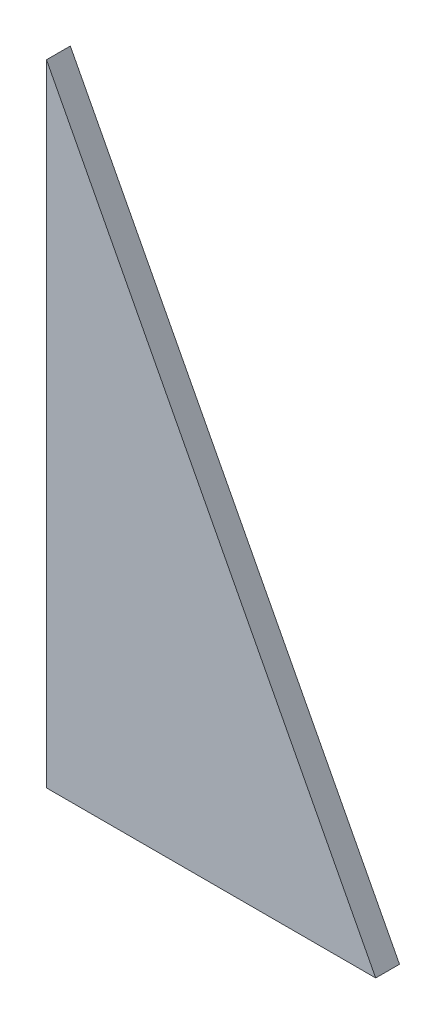
ISO-10303-21;
HEADER;
FILE_DESCRIPTION(('STEP AP214'),'2;1');
FILE_NAME('part.step','',(''),(''),'','','');
FILE_SCHEMA(('AUTOMOTIVE_DESIGN { 1 0 10303 214 1 1 1 1 }'));
ENDSEC;
DATA;
#1=APPLICATION_CONTEXT('core data for automotive mechanical design processes');
#2=APPLICATION_PROTOCOL_DEFINITION('international standard','automotive_design',2000,#1);
#3=PRODUCT_CONTEXT('',#1,'mechanical');
#4=PRODUCT('Part','Part','',(#3));
#5=PRODUCT_RELATED_PRODUCT_CATEGORY('part','',(#4));
#6=PRODUCT_DEFINITION_FORMATION('','',#4);
#7=PRODUCT_DEFINITION_CONTEXT('part definition',#1,'design');
#8=PRODUCT_DEFINITION('design','',#6,#7);
#9=PRODUCT_DEFINITION_SHAPE('','',#8);
#10=(LENGTH_UNIT() NAMED_UNIT(*) SI_UNIT(.MILLI.,.METRE.));
#11=(NAMED_UNIT(*) PLANE_ANGLE_UNIT() SI_UNIT($,.RADIAN.));
#12=(NAMED_UNIT(*) SI_UNIT($,.STERADIAN.) SOLID_ANGLE_UNIT());
#13=UNCERTAINTY_MEASURE_WITH_UNIT(LENGTH_MEASURE(1.E-05),#10,'distance_accuracy_value','');
#14=(GEOMETRIC_REPRESENTATION_CONTEXT(3) GLOBAL_UNCERTAINTY_ASSIGNED_CONTEXT((#13)) GLOBAL_UNIT_ASSIGNED_CONTEXT((#10,
#11,#12)) REPRESENTATION_CONTEXT('',''));
#15=CARTESIAN_POINT('',(0.,0.,0.));
#16=DIRECTION('',(0.,0.,1.));
#17=DIRECTION('',(1.,0.,0.));
#18=AXIS2_PLACEMENT_3D('',#15,#16,#17);
#19=CARTESIAN_POINT('',(249.,0.,18.));
#20=DIRECTION('',(-0.886485413269205,-0.462756536486441,0.));
#21=DIRECTION('',(0.462756536486441,-0.886485413269205,0.));
#22=AXIS2_PLACEMENT_3D('',#19,#20,#21);
#23=PLANE('',#22);
#24=DIRECTION('',(-0.462756536486441,0.886485413269205,0.));
#25=VECTOR('',#24,1.);
#26=CARTESIAN_POINT('',(249.,0.,0.));
#27=LINE('',#26,#25);
#28=CARTESIAN_POINT('',(249.,0.,0.));
#29=VERTEX_POINT('',#28);
#30=CARTESIAN_POINT('',(-1.11022302462516E-13,477.,0.));
#31=VERTEX_POINT('',#30);
#32=EDGE_CURVE('E75',#29,#31,#27,.T.);
#33=ORIENTED_EDGE('',*,*,#32,.T.);
#34=DIRECTION('',(0.,0.,-1.));
#35=VECTOR('',#34,1.);
#36=CARTESIAN_POINT('',(-1.11022302462516E-13,477.,18.));
#37=LINE('',#36,#35);
#38=CARTESIAN_POINT('',(-1.11022302462516E-13,477.,18.));
#39=VERTEX_POINT('',#38);
#40=EDGE_CURVE('E11',#39,#31,#37,.T.);
#41=ORIENTED_EDGE('',*,*,#40,.F.);
#42=DIRECTION('',(-0.462756536486441,0.886485413269205,0.));
#43=VECTOR('',#42,1.);
#44=CARTESIAN_POINT('',(249.,0.,18.));
#45=LINE('',#44,#43);
#46=CARTESIAN_POINT('',(249.,0.,18.));
#47=VERTEX_POINT('',#46);
#48=EDGE_CURVE('E68',#47,#39,#45,.T.);
#49=ORIENTED_EDGE('',*,*,#48,.F.);
#50=DIRECTION('',(0.,0.,-1.));
#51=VECTOR('',#50,1.);
#52=CARTESIAN_POINT('',(249.,0.,18.));
#53=LINE('',#52,#51);
#54=EDGE_CURVE('E76',#47,#29,#53,.T.);
#55=ORIENTED_EDGE('',*,*,#54,.T.);
#56=EDGE_LOOP('',(#33,#41,#49,#55));
#57=FACE_BOUND('',#56,.T.);
#58=ADVANCED_FACE('F28',(#57),#23,.F.);
#59=CARTESIAN_POINT('',(-1.11022302462516E-13,477.,18.));
#60=DIRECTION('',(1.,0.,0.));
#61=DIRECTION('',(0.,1.,0.));
#62=AXIS2_PLACEMENT_3D('',#59,#60,#61);
#63=PLANE('',#62);
#64=DIRECTION('',(0.,-1.,0.));
#65=VECTOR('',#64,1.);
#66=CARTESIAN_POINT('',(-1.11022302462516E-13,477.,0.));
#67=LINE('',#66,#65);
#68=CARTESIAN_POINT('',(0.,0.,0.));
#69=VERTEX_POINT('',#68);
#70=EDGE_CURVE('E56',#31,#69,#67,.T.);
#71=ORIENTED_EDGE('',*,*,#70,.T.);
#72=DIRECTION('',(0.,0.,-1.));
#73=VECTOR('',#72,1.);
#74=CARTESIAN_POINT('',(0.,0.,18.));
#75=LINE('',#74,#73);
#76=CARTESIAN_POINT('',(0.,0.,18.));
#77=VERTEX_POINT('',#76);
#78=EDGE_CURVE('E36',#77,#69,#75,.T.);
#79=ORIENTED_EDGE('',*,*,#78,.F.);
#80=DIRECTION('',(0.,-1.,0.));
#81=VECTOR('',#80,1.);
#82=CARTESIAN_POINT('',(-1.11022302462516E-13,477.,18.));
#83=LINE('',#82,#81);
#84=EDGE_CURVE('E64',#39,#77,#83,.T.);
#85=ORIENTED_EDGE('',*,*,#84,.F.);
#86=ORIENTED_EDGE('',*,*,#40,.T.);
#87=EDGE_LOOP('',(#71,#79,#85,#86));
#88=FACE_BOUND('',#87,.T.);
#89=ADVANCED_FACE('F65',(#88),#63,.F.);
#90=CARTESIAN_POINT('',(0.,0.,18.));
#91=DIRECTION('',(0.,1.,0.));
#92=DIRECTION('',(0.,0.,1.));
#93=AXIS2_PLACEMENT_3D('',#90,#91,#92);
#94=PLANE('',#93);
#95=DIRECTION('',(1.,0.,0.));
#96=VECTOR('',#95,1.);
#97=CARTESIAN_POINT('',(0.,0.,0.));
#98=LINE('',#97,#96);
#99=EDGE_CURVE('E61',#69,#29,#98,.T.);
#100=ORIENTED_EDGE('',*,*,#99,.T.);
#101=ORIENTED_EDGE('',*,*,#54,.F.);
#102=DIRECTION('',(1.,0.,0.));
#103=VECTOR('',#102,1.);
#104=CARTESIAN_POINT('',(0.,0.,18.));
#105=LINE('',#104,#103);
#106=EDGE_CURVE('E44',#77,#47,#105,.T.);
#107=ORIENTED_EDGE('',*,*,#106,.F.);
#108=ORIENTED_EDGE('',*,*,#78,.T.);
#109=EDGE_LOOP('',(#100,#101,#107,#108));
#110=FACE_BOUND('',#109,.T.);
#111=ADVANCED_FACE('F83',(#110),#94,.F.);
#112=CARTESIAN_POINT('',(0.,0.,18.));
#113=DIRECTION('',(0.,0.,-1.));
#114=DIRECTION('',(-1.,0.,0.));
#115=AXIS2_PLACEMENT_3D('',#112,#113,#114);
#116=PLANE('',#115);
#117=ORIENTED_EDGE('',*,*,#48,.T.);
#118=ORIENTED_EDGE('',*,*,#84,.T.);
#119=ORIENTED_EDGE('',*,*,#106,.T.);
#120=EDGE_LOOP('',(#117,#118,#119));
#121=FACE_BOUND('',#120,.T.);
#122=ADVANCED_FACE('F71',(#121),#116,.F.);
#123=CARTESIAN_POINT('',(0.,0.,0.));
#124=DIRECTION('',(0.,0.,-1.));
#125=DIRECTION('',(-1.,0.,0.));
#126=AXIS2_PLACEMENT_3D('',#123,#124,#125);
#127=PLANE('',#126);
#128=ORIENTED_EDGE('',*,*,#32,.F.);
#129=ORIENTED_EDGE('',*,*,#99,.F.);
#130=ORIENTED_EDGE('',*,*,#70,.F.);
#131=EDGE_LOOP('',(#128,#129,#130));
#132=FACE_BOUND('',#131,.T.);
#133=ADVANCED_FACE('F84',(#132),#127,.T.);
#134=CLOSED_SHELL('',(#58,#89,#111,#122,#133));
#135=MANIFOLD_SOLID_BREP('B2',#134);
#136=ADVANCED_BREP_SHAPE_REPRESENTATION('',(#18,#135),#14);
#137=SHAPE_DEFINITION_REPRESENTATION(#9,#136);
ENDSEC;
END-ISO-10303-21;
